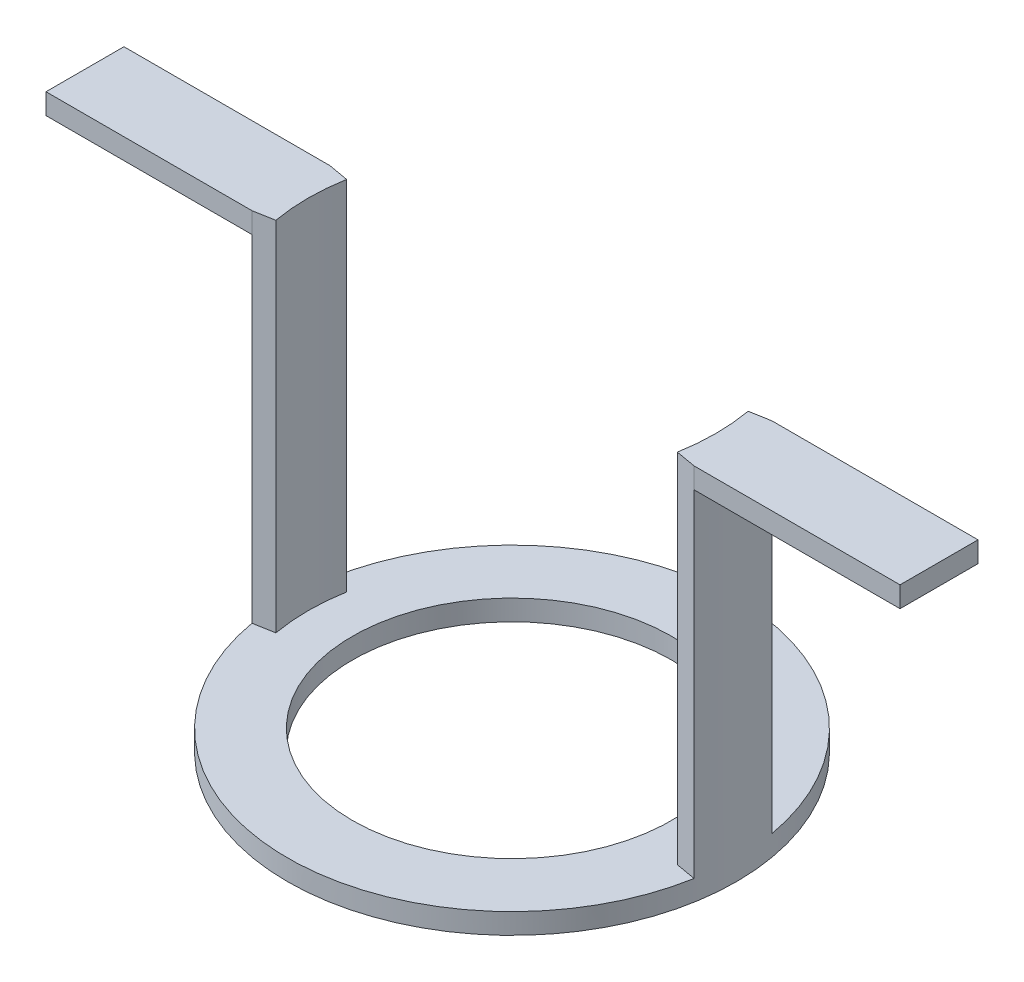
ISO-10303-21;
HEADER;
FILE_DESCRIPTION(('STEP AP214'),'2;1');
FILE_NAME('part.step','',(''),(''),'','','');
FILE_SCHEMA(('AUTOMOTIVE_DESIGN { 1 0 10303 214 1 1 1 1 }'));
ENDSEC;
DATA;
#1=APPLICATION_CONTEXT('core data for automotive mechanical design processes');
#2=APPLICATION_PROTOCOL_DEFINITION('international standard','automotive_design',2000,#1);
#3=PRODUCT_CONTEXT('',#1,'mechanical');
#4=PRODUCT('Part','Part','',(#3));
#5=PRODUCT_RELATED_PRODUCT_CATEGORY('part','',(#4));
#6=PRODUCT_DEFINITION_FORMATION('','',#4);
#7=PRODUCT_DEFINITION_CONTEXT('part definition',#1,'design');
#8=PRODUCT_DEFINITION('design','',#6,#7);
#9=PRODUCT_DEFINITION_SHAPE('','',#8);
#10=(LENGTH_UNIT() NAMED_UNIT(*) SI_UNIT(.MILLI.,.METRE.));
#11=(NAMED_UNIT(*) PLANE_ANGLE_UNIT() SI_UNIT($,.RADIAN.));
#12=(NAMED_UNIT(*) SI_UNIT($,.STERADIAN.) SOLID_ANGLE_UNIT());
#13=UNCERTAINTY_MEASURE_WITH_UNIT(LENGTH_MEASURE(1.E-05),#10,'distance_accuracy_value','');
#14=(GEOMETRIC_REPRESENTATION_CONTEXT(3) GLOBAL_UNCERTAINTY_ASSIGNED_CONTEXT((#13)) GLOBAL_UNIT_ASSIGNED_CONTEXT((#10,
#11,#12)) REPRESENTATION_CONTEXT('',''));
#15=CARTESIAN_POINT('',(0.,0.,0.));
#16=DIRECTION('',(0.,0.,1.));
#17=DIRECTION('',(1.,0.,0.));
#18=AXIS2_PLACEMENT_3D('',#15,#16,#17);
#19=CARTESIAN_POINT('',(0.,2.,0.));
#20=DIRECTION('',(0.,-1.,0.));
#21=DIRECTION('',(0.,0.,-1.));
#22=AXIS2_PLACEMENT_3D('',#19,#20,#21);
#23=CYLINDRICAL_SURFACE('',#22,21.8);
#24=CARTESIAN_POINT('',(0.,0.,0.));
#25=DIRECTION('',(0.,1.,0.));
#26=DIRECTION('',(0.,0.,1.));
#27=AXIS2_PLACEMENT_3D('',#24,#25,#26);
#28=CIRCLE('',#27,21.8);
#29=CARTESIAN_POINT('',(0.,0.,21.8));
#30=VERTEX_POINT('',#29);
#31=EDGE_CURVE('E250',#30,#30,#28,.T.);
#32=ORIENTED_EDGE('',*,*,#31,.T.);
#33=EDGE_LOOP('',(#32));
#34=FACE_BOUND('',#33,.T.);
#35=CARTESIAN_POINT('',(0.,34.6889226928998,0.));
#36=DIRECTION('',(0.,1.,0.));
#37=DIRECTION('',(0.,0.,1.));
#38=AXIS2_PLACEMENT_3D('',#35,#36,#37);
#39=CIRCLE('',#38,21.8);
#40=CARTESIAN_POINT('',(-21.4688090156661,34.6889226928998,3.78553027313909));
#41=VERTEX_POINT('',#40);
#42=CARTESIAN_POINT('',(-21.4688090156661,34.6889226928998,-3.78553027313907));
#43=VERTEX_POINT('',#42);
#44=EDGE_CURVE('E171',#41,#43,#39,.F.);
#45=ORIENTED_EDGE('',*,*,#44,.T.);
#46=DIRECTION('',(0.,-1.,0.));
#47=VECTOR('',#46,1.);
#48=CARTESIAN_POINT('',(-21.4688090156661,36.7,-3.78553027313907));
#49=LINE('',#48,#47);
#50=CARTESIAN_POINT('',(-21.4688090156661,2.,-3.78553027313909));
#51=VERTEX_POINT('',#50);
#52=EDGE_CURVE('E243',#43,#51,#49,.T.);
#53=ORIENTED_EDGE('',*,*,#52,.T.);
#54=CARTESIAN_POINT('',(0.,2.,0.));
#55=DIRECTION('',(0.,1.,0.));
#56=DIRECTION('',(0.,0.,1.));
#57=AXIS2_PLACEMENT_3D('',#54,#55,#56);
#58=CIRCLE('',#57,21.8);
#59=CARTESIAN_POINT('',(21.4688090156661,2.,-3.78553027313909));
#60=VERTEX_POINT('',#59);
#61=EDGE_CURVE('E41',#60,#51,#58,.T.);
#62=ORIENTED_EDGE('',*,*,#61,.F.);
#63=DIRECTION('',(0.,-1.,0.));
#64=VECTOR('',#63,1.);
#65=CARTESIAN_POINT('',(21.4688090156661,36.7,-3.78553027313909));
#66=LINE('',#65,#64);
#67=CARTESIAN_POINT('',(21.4688090156661,34.6889226928998,-3.78553027313909));
#68=VERTEX_POINT('',#67);
#69=EDGE_CURVE('E217',#68,#60,#66,.T.);
#70=ORIENTED_EDGE('',*,*,#69,.F.);
#71=CARTESIAN_POINT('',(0.,34.6889226928998,0.));
#72=DIRECTION('',(0.,-1.,0.));
#73=DIRECTION('',(0.,0.,-1.));
#74=AXIS2_PLACEMENT_3D('',#71,#72,#73);
#75=CIRCLE('',#74,21.8);
#76=CARTESIAN_POINT('',(21.4688090156661,34.6889226928998,3.78553027313909));
#77=VERTEX_POINT('',#76);
#78=EDGE_CURVE('E191',#77,#68,#75,.F.);
#79=ORIENTED_EDGE('',*,*,#78,.F.);
#80=DIRECTION('',(0.,-1.,0.));
#81=VECTOR('',#80,1.);
#82=CARTESIAN_POINT('',(21.4688090156661,36.7,3.78553027313909));
#83=LINE('',#82,#81);
#84=CARTESIAN_POINT('',(21.4688090156661,2.,3.78553027313909));
#85=VERTEX_POINT('',#84);
#86=EDGE_CURVE('E205',#77,#85,#83,.T.);
#87=ORIENTED_EDGE('',*,*,#86,.T.);
#88=CARTESIAN_POINT('',(-21.4688090156661,2.,3.78553027313909));
#89=VERTEX_POINT('',#88);
#90=EDGE_CURVE('E11',#89,#85,#58,.T.);
#91=ORIENTED_EDGE('',*,*,#90,.F.);
#92=DIRECTION('',(0.,-1.,0.));
#93=VECTOR('',#92,1.);
#94=CARTESIAN_POINT('',(-21.4688090156661,36.7,3.78553027313909));
#95=LINE('',#94,#93);
#96=EDGE_CURVE('E239',#41,#89,#95,.T.);
#97=ORIENTED_EDGE('',*,*,#96,.F.);
#98=EDGE_LOOP('',(#45,#53,#62,#70,#79,#87,#91,#97));
#99=FACE_BOUND('',#98,.T.);
#100=ADVANCED_FACE('F33',(#34,#99),#23,.T.);
#101=CARTESIAN_POINT('',(0.,2.,0.));
#102=DIRECTION('',(0.,1.,0.));
#103=DIRECTION('',(0.,0.,1.));
#104=AXIS2_PLACEMENT_3D('',#101,#102,#103);
#105=PLANE('',#104);
#106=CARTESIAN_POINT('',(0.,2.,0.));
#107=DIRECTION('',(0.,1.,0.));
#108=DIRECTION('',(0.,0.,1.));
#109=AXIS2_PLACEMENT_3D('',#106,#107,#108);
#110=CIRCLE('',#109,15.5);
#111=CARTESIAN_POINT('',(0.,2.,15.5));
#112=VERTEX_POINT('',#111);
#113=EDGE_CURVE('E248',#112,#112,#110,.T.);
#114=ORIENTED_EDGE('',*,*,#113,.F.);
#115=EDGE_LOOP('',(#114));
#116=FACE_BOUND('',#115,.T.);
#117=CARTESIAN_POINT('',(0.,2.,0.));
#118=DIRECTION('',(0.,-1.,0.));
#119=DIRECTION('',(0.,0.,-1.));
#120=AXIS2_PLACEMENT_3D('',#117,#118,#119);
#121=CIRCLE('',#120,19.7998050254632);
#122=CARTESIAN_POINT('',(19.4990014972063,2.,-3.43820006083222));
#123=VERTEX_POINT('',#122);
#124=CARTESIAN_POINT('',(19.4990014972063,2.,3.43820006083222));
#125=VERTEX_POINT('',#124);
#126=EDGE_CURVE('E207',#123,#125,#121,.T.);
#127=ORIENTED_EDGE('',*,*,#126,.F.);
#128=DIRECTION('',(-0.984807753012208,0.,0.173648177666931));
#129=VECTOR('',#128,1.);
#130=CARTESIAN_POINT('',(21.4688090156661,2.,-3.78553027313909));
#131=LINE('',#130,#129);
#132=EDGE_CURVE('E188',#60,#123,#131,.T.);
#133=ORIENTED_EDGE('',*,*,#132,.F.);
#134=ORIENTED_EDGE('',*,*,#61,.T.);
#135=DIRECTION('',(-0.984807753012208,0.,-0.173648177666931));
#136=VECTOR('',#135,1.);
#137=CARTESIAN_POINT('',(-19.4991669611093,2.,-3.43822923658267));
#138=LINE('',#137,#136);
#139=CARTESIAN_POINT('',(-19.4991669611093,2.,-3.43822923658267));
#140=VERTEX_POINT('',#139);
#141=EDGE_CURVE('E57',#140,#51,#138,.T.);
#142=ORIENTED_EDGE('',*,*,#141,.F.);
#143=CARTESIAN_POINT('',(0.,2.,0.));
#144=DIRECTION('',(0.,-1.,0.));
#145=DIRECTION('',(0.,0.,1.));
#146=AXIS2_PLACEMENT_3D('',#143,#144,#145);
#147=CIRCLE('',#146,19.7999730419137);
#148=CARTESIAN_POINT('',(-19.4991669611093,2.,3.43822923658265));
#149=VERTEX_POINT('',#148);
#150=EDGE_CURVE('E225',#149,#140,#147,.T.);
#151=ORIENTED_EDGE('',*,*,#150,.F.);
#152=DIRECTION('',(0.984807753012208,0.,-0.173648177666931));
#153=VECTOR('',#152,1.);
#154=CARTESIAN_POINT('',(-19.4991669611093,2.,3.43822923658267));
#155=LINE('',#154,#153);
#156=EDGE_CURVE('E233',#89,#149,#155,.T.);
#157=ORIENTED_EDGE('',*,*,#156,.F.);
#158=ORIENTED_EDGE('',*,*,#90,.T.);
#159=DIRECTION('',(0.984807753012208,0.,0.173648177666931));
#160=VECTOR('',#159,1.);
#161=CARTESIAN_POINT('',(21.4688090156661,2.,3.78553027313909));
#162=LINE('',#161,#160);
#163=EDGE_CURVE('E200',#125,#85,#162,.T.);
#164=ORIENTED_EDGE('',*,*,#163,.F.);
#165=EDGE_LOOP('',(#127,#133,#134,#142,#151,#157,#158,#164));
#166=FACE_BOUND('',#165,.T.);
#167=ADVANCED_FACE('F273',(#116,#166),#105,.T.);
#168=CARTESIAN_POINT('',(0.,0.,0.));
#169=DIRECTION('',(0.,1.,0.));
#170=DIRECTION('',(0.,0.,1.));
#171=AXIS2_PLACEMENT_3D('',#168,#169,#170);
#172=PLANE('',#171);
#173=CARTESIAN_POINT('',(0.,0.,0.));
#174=DIRECTION('',(0.,1.,0.));
#175=DIRECTION('',(0.,0.,1.));
#176=AXIS2_PLACEMENT_3D('',#173,#174,#175);
#177=CIRCLE('',#176,15.5);
#178=CARTESIAN_POINT('',(0.,0.,15.5));
#179=VERTEX_POINT('',#178);
#180=EDGE_CURVE('E36',#179,#179,#177,.T.);
#181=ORIENTED_EDGE('',*,*,#180,.T.);
#182=EDGE_LOOP('',(#181));
#183=FACE_BOUND('',#182,.T.);
#184=ORIENTED_EDGE('',*,*,#31,.F.);
#185=EDGE_LOOP('',(#184));
#186=FACE_BOUND('',#185,.T.);
#187=ADVANCED_FACE('F257',(#183,#186),#172,.F.);
#188=CARTESIAN_POINT('',(0.,-14.,0.));
#189=DIRECTION('',(0.,1.,0.));
#190=DIRECTION('',(0.,0.,1.));
#191=AXIS2_PLACEMENT_3D('',#188,#189,#190);
#192=CYLINDRICAL_SURFACE('',#191,15.5);
#193=ORIENTED_EDGE('',*,*,#113,.T.);
#194=EDGE_LOOP('',(#193));
#195=FACE_BOUND('',#194,.T.);
#196=ORIENTED_EDGE('',*,*,#180,.F.);
#197=EDGE_LOOP('',(#196));
#198=FACE_BOUND('',#197,.T.);
#199=ADVANCED_FACE('F260',(#195,#198),#192,.F.);
#200=CARTESIAN_POINT('',(-19.4991669611093,36.7,-3.43822923658267));
#201=DIRECTION('',(-0.173648177666931,0.,0.984807753012208));
#202=DIRECTION('',(0.984807753012208,0.,0.173648177666931));
#203=AXIS2_PLACEMENT_3D('',#200,#201,#202);
#204=PLANE('',#203);
#205=ORIENTED_EDGE('',*,*,#141,.T.);
#206=ORIENTED_EDGE('',*,*,#52,.F.);
#207=CARTESIAN_POINT('',(-21.4688090156661,36.7,-3.78553027313907));
#208=VERTEX_POINT('',#207);
#209=EDGE_CURVE('E144',#208,#43,#49,.T.);
#210=ORIENTED_EDGE('',*,*,#209,.F.);
#211=DIRECTION('',(-0.984807753012208,0.,-0.173648177666931));
#212=VECTOR('',#211,1.);
#213=CARTESIAN_POINT('',(-19.4991669611093,36.7,-3.43822923658267));
#214=LINE('',#213,#212);
#215=CARTESIAN_POINT('',(-19.4991669611093,36.7,-3.43822923658267));
#216=VERTEX_POINT('',#215);
#217=EDGE_CURVE('E224',#216,#208,#214,.T.);
#218=ORIENTED_EDGE('',*,*,#217,.F.);
#219=DIRECTION('',(0.,-1.,0.));
#220=VECTOR('',#219,1.);
#221=CARTESIAN_POINT('',(-19.4991669611093,36.7,-3.43822923658267));
#222=LINE('',#221,#220);
#223=EDGE_CURVE('E245',#216,#140,#222,.T.);
#224=ORIENTED_EDGE('',*,*,#223,.T.);
#225=EDGE_LOOP('',(#205,#206,#210,#218,#224));
#226=FACE_BOUND('',#225,.T.);
#227=ADVANCED_FACE('F262',(#226),#204,.F.);
#228=CARTESIAN_POINT('',(-19.4991669611093,36.7,3.43822923658267));
#229=DIRECTION('',(-0.173648177666931,0.,-0.984807753012208));
#230=DIRECTION('',(-0.984807753012208,0.,0.173648177666931));
#231=AXIS2_PLACEMENT_3D('',#228,#229,#230);
#232=PLANE('',#231);
#233=ORIENTED_EDGE('',*,*,#156,.T.);
#234=DIRECTION('',(0.,-1.,0.));
#235=VECTOR('',#234,1.);
#236=CARTESIAN_POINT('',(-19.4991669611093,36.7,3.43822923658265));
#237=LINE('',#236,#235);
#238=CARTESIAN_POINT('',(-19.4991669611093,36.7,3.43822923658265));
#239=VERTEX_POINT('',#238);
#240=EDGE_CURVE('E231',#239,#149,#237,.T.);
#241=ORIENTED_EDGE('',*,*,#240,.F.);
#242=DIRECTION('',(0.984807753012208,0.,-0.173648177666931));
#243=VECTOR('',#242,1.);
#244=CARTESIAN_POINT('',(-19.4991669611093,36.7,3.43822923658267));
#245=LINE('',#244,#243);
#246=CARTESIAN_POINT('',(-21.4688090156661,36.7,3.78553027313909));
#247=VERTEX_POINT('',#246);
#248=EDGE_CURVE('E228',#247,#239,#245,.T.);
#249=ORIENTED_EDGE('',*,*,#248,.F.);
#250=EDGE_CURVE('E240',#247,#41,#95,.T.);
#251=ORIENTED_EDGE('',*,*,#250,.T.);
#252=ORIENTED_EDGE('',*,*,#96,.T.);
#253=EDGE_LOOP('',(#233,#241,#249,#251,#252));
#254=FACE_BOUND('',#253,.T.);
#255=ADVANCED_FACE('F270',(#254),#232,.F.);
#256=CARTESIAN_POINT('',(0.,36.7,0.));
#257=DIRECTION('',(0.,-1.,0.));
#258=DIRECTION('',(0.,0.,-1.));
#259=AXIS2_PLACEMENT_3D('',#256,#257,#258);
#260=CYLINDRICAL_SURFACE('',#259,19.7999730419137);
#261=ORIENTED_EDGE('',*,*,#150,.T.);
#262=ORIENTED_EDGE('',*,*,#223,.F.);
#263=CARTESIAN_POINT('',(0.,36.7,0.));
#264=DIRECTION('',(0.,-1.,0.));
#265=DIRECTION('',(0.,0.,-1.));
#266=AXIS2_PLACEMENT_3D('',#263,#264,#265);
#267=CIRCLE('',#266,19.7999730419137);
#268=EDGE_CURVE('E221',#239,#216,#267,.T.);
#269=ORIENTED_EDGE('',*,*,#268,.F.);
#270=ORIENTED_EDGE('',*,*,#240,.T.);
#271=EDGE_LOOP('',(#261,#262,#269,#270));
#272=FACE_BOUND('',#271,.T.);
#273=ADVANCED_FACE('F287',(#272),#260,.F.);
#274=CARTESIAN_POINT('',(0.,36.7,0.));
#275=DIRECTION('',(0.,-1.,0.));
#276=DIRECTION('',(0.,0.,-1.));
#277=AXIS2_PLACEMENT_3D('',#274,#275,#276);
#278=PLANE('',#277);
#279=ORIENTED_EDGE('',*,*,#268,.T.);
#280=ORIENTED_EDGE('',*,*,#217,.T.);
#281=DIRECTION('',(-1.,0.,0.));
#282=VECTOR('',#281,1.);
#283=CARTESIAN_POINT('',(41.471,36.7,-3.78553027313907));
#284=LINE('',#283,#282);
#285=CARTESIAN_POINT('',(-41.47,36.7,-3.78553027313907));
#286=VERTEX_POINT('',#285);
#287=EDGE_CURVE('E169',#208,#286,#284,.T.);
#288=ORIENTED_EDGE('',*,*,#287,.T.);
#289=DIRECTION('',(0.,0.,-1.));
#290=VECTOR('',#289,1.);
#291=CARTESIAN_POINT('',(-41.47,36.7,-3.78553027313907));
#292=LINE('',#291,#290);
#293=CARTESIAN_POINT('',(-41.47,36.7,3.78553027313909));
#294=VERTEX_POINT('',#293);
#295=EDGE_CURVE('E149',#294,#286,#292,.T.);
#296=ORIENTED_EDGE('',*,*,#295,.F.);
#297=DIRECTION('',(-1.,0.,0.));
#298=VECTOR('',#297,1.);
#299=CARTESIAN_POINT('',(41.471,36.7,3.78553027313909));
#300=LINE('',#299,#298);
#301=EDGE_CURVE('E167',#247,#294,#300,.T.);
#302=ORIENTED_EDGE('',*,*,#301,.F.);
#303=ORIENTED_EDGE('',*,*,#248,.T.);
#304=EDGE_LOOP('',(#279,#280,#288,#296,#302,#303));
#305=FACE_BOUND('',#304,.T.);
#306=ADVANCED_FACE('F297',(#305),#278,.F.);
#307=CARTESIAN_POINT('',(21.4688090156661,36.7,-3.78553027313909));
#308=DIRECTION('',(0.173648177666931,0.,0.984807753012208));
#309=DIRECTION('',(0.984807753012208,0.,-0.173648177666931));
#310=AXIS2_PLACEMENT_3D('',#307,#308,#309);
#311=PLANE('',#310);
#312=ORIENTED_EDGE('',*,*,#132,.T.);
#313=DIRECTION('',(0.,-1.,0.));
#314=VECTOR('',#313,1.);
#315=CARTESIAN_POINT('',(19.4990014972063,36.7,-3.43820006083222));
#316=LINE('',#315,#314);
#317=CARTESIAN_POINT('',(19.4990014972063,36.7,-3.43820006083222));
#318=VERTEX_POINT('',#317);
#319=EDGE_CURVE('E214',#318,#123,#316,.T.);
#320=ORIENTED_EDGE('',*,*,#319,.F.);
#321=DIRECTION('',(-0.984807753012208,0.,0.173648177666931));
#322=VECTOR('',#321,1.);
#323=CARTESIAN_POINT('',(21.4688090156661,36.7,-3.78553027313909));
#324=LINE('',#323,#322);
#325=CARTESIAN_POINT('',(21.4688090156661,36.7,-3.78553027313909));
#326=VERTEX_POINT('',#325);
#327=EDGE_CURVE('E197',#326,#318,#324,.T.);
#328=ORIENTED_EDGE('',*,*,#327,.F.);
#329=EDGE_CURVE('E218',#326,#68,#66,.T.);
#330=ORIENTED_EDGE('',*,*,#329,.T.);
#331=ORIENTED_EDGE('',*,*,#69,.T.);
#332=EDGE_LOOP('',(#312,#320,#328,#330,#331));
#333=FACE_BOUND('',#332,.T.);
#334=ADVANCED_FACE('F299',(#333),#311,.F.);
#335=CARTESIAN_POINT('',(0.,36.7,0.));
#336=DIRECTION('',(0.,-1.,0.));
#337=DIRECTION('',(0.,0.,-1.));
#338=AXIS2_PLACEMENT_3D('',#335,#336,#337);
#339=CYLINDRICAL_SURFACE('',#338,19.7998050254632);
#340=ORIENTED_EDGE('',*,*,#126,.T.);
#341=DIRECTION('',(0.,-1.,0.));
#342=VECTOR('',#341,1.);
#343=CARTESIAN_POINT('',(19.4990014972063,36.7,3.43820006083222));
#344=LINE('',#343,#342);
#345=CARTESIAN_POINT('',(19.4990014972063,36.7,3.43820006083222));
#346=VERTEX_POINT('',#345);
#347=EDGE_CURVE('E49',#346,#125,#344,.T.);
#348=ORIENTED_EDGE('',*,*,#347,.F.);
#349=CARTESIAN_POINT('',(0.,36.7,0.));
#350=DIRECTION('',(0.,-1.,0.));
#351=DIRECTION('',(0.,0.,1.));
#352=AXIS2_PLACEMENT_3D('',#349,#350,#351);
#353=CIRCLE('',#352,19.7998050254632);
#354=EDGE_CURVE('E199',#318,#346,#353,.T.);
#355=ORIENTED_EDGE('',*,*,#354,.F.);
#356=ORIENTED_EDGE('',*,*,#319,.T.);
#357=EDGE_LOOP('',(#340,#348,#355,#356));
#358=FACE_BOUND('',#357,.T.);
#359=ADVANCED_FACE('F305',(#358),#339,.F.);
#360=CARTESIAN_POINT('',(21.4688090156661,36.7,3.78553027313909));
#361=DIRECTION('',(0.173648177666931,0.,-0.984807753012208));
#362=DIRECTION('',(-0.984807753012208,0.,-0.173648177666931));
#363=AXIS2_PLACEMENT_3D('',#360,#361,#362);
#364=PLANE('',#363);
#365=ORIENTED_EDGE('',*,*,#163,.T.);
#366=ORIENTED_EDGE('',*,*,#86,.F.);
#367=CARTESIAN_POINT('',(21.4688090156661,36.7,3.78553027313909));
#368=VERTEX_POINT('',#367);
#369=EDGE_CURVE('E210',#368,#77,#83,.T.);
#370=ORIENTED_EDGE('',*,*,#369,.F.);
#371=DIRECTION('',(0.984807753012208,0.,0.173648177666931));
#372=VECTOR('',#371,1.);
#373=CARTESIAN_POINT('',(21.4688090156661,36.7,3.78553027313909));
#374=LINE('',#373,#372);
#375=EDGE_CURVE('E202',#346,#368,#374,.T.);
#376=ORIENTED_EDGE('',*,*,#375,.F.);
#377=ORIENTED_EDGE('',*,*,#347,.T.);
#378=EDGE_LOOP('',(#365,#366,#370,#376,#377));
#379=FACE_BOUND('',#378,.T.);
#380=ADVANCED_FACE('F333',(#379),#364,.F.);
#381=CARTESIAN_POINT('',(0.,36.7,0.));
#382=DIRECTION('',(0.,-1.,0.));
#383=DIRECTION('',(0.,0.,-1.));
#384=AXIS2_PLACEMENT_3D('',#381,#382,#383);
#385=PLANE('',#384);
#386=ORIENTED_EDGE('',*,*,#375,.T.);
#387=DIRECTION('',(1.,0.,0.));
#388=VECTOR('',#387,1.);
#389=CARTESIAN_POINT('',(-21.801,36.7,3.78553027313909));
#390=LINE('',#389,#388);
#391=CARTESIAN_POINT('',(41.47,36.7,3.78553027313909));
#392=VERTEX_POINT('',#391);
#393=EDGE_CURVE('E185',#368,#392,#390,.T.);
#394=ORIENTED_EDGE('',*,*,#393,.T.);
#395=DIRECTION('',(0.,0.,1.));
#396=VECTOR('',#395,1.);
#397=CARTESIAN_POINT('',(41.47,36.7,-3.78553027313907));
#398=LINE('',#397,#396);
#399=CARTESIAN_POINT('',(41.47,36.7,-3.78553027313907));
#400=VERTEX_POINT('',#399);
#401=EDGE_CURVE('E176',#400,#392,#398,.T.);
#402=ORIENTED_EDGE('',*,*,#401,.F.);
#403=DIRECTION('',(1.,0.,0.));
#404=VECTOR('',#403,1.);
#405=CARTESIAN_POINT('',(-21.801,36.7,-3.78553027313907));
#406=LINE('',#405,#404);
#407=EDGE_CURVE('E186',#326,#400,#406,.T.);
#408=ORIENTED_EDGE('',*,*,#407,.F.);
#409=ORIENTED_EDGE('',*,*,#327,.T.);
#410=ORIENTED_EDGE('',*,*,#354,.T.);
#411=EDGE_LOOP('',(#386,#394,#402,#408,#409,#410));
#412=FACE_BOUND('',#411,.T.);
#413=ADVANCED_FACE('F349',(#412),#385,.F.);
#414=CARTESIAN_POINT('',(-21.801,36.7,3.78553027313909));
#415=DIRECTION('',(0.,0.,1.));
#416=DIRECTION('',(1.,0.,0.));
#417=AXIS2_PLACEMENT_3D('',#414,#415,#416);
#418=PLANE('',#417);
#419=ORIENTED_EDGE('',*,*,#393,.F.);
#420=ORIENTED_EDGE('',*,*,#369,.T.);
#421=DIRECTION('',(1.,0.,0.));
#422=VECTOR('',#421,1.);
#423=CARTESIAN_POINT('',(-21.801,34.6889226928998,3.78553027313909));
#424=LINE('',#423,#422);
#425=CARTESIAN_POINT('',(41.47,34.6889226928998,3.78553027313909));
#426=VERTEX_POINT('',#425);
#427=EDGE_CURVE('E194',#77,#426,#424,.T.);
#428=ORIENTED_EDGE('',*,*,#427,.T.);
#429=DIRECTION('',(0.,-1.,0.));
#430=VECTOR('',#429,1.);
#431=CARTESIAN_POINT('',(41.47,34.6889226928998,3.78553027313909));
#432=LINE('',#431,#430);
#433=EDGE_CURVE('E179',#392,#426,#432,.T.);
#434=ORIENTED_EDGE('',*,*,#433,.F.);
#435=EDGE_LOOP('',(#419,#420,#428,#434));
#436=FACE_BOUND('',#435,.T.);
#437=ADVANCED_FACE('F359',(#436),#418,.T.);
#438=CARTESIAN_POINT('',(-21.801,34.6889226928998,-3.78553027313907));
#439=DIRECTION('',(0.,-1.,0.));
#440=DIRECTION('',(0.,0.,-1.));
#441=AXIS2_PLACEMENT_3D('',#438,#439,#440);
#442=PLANE('',#441);
#443=ORIENTED_EDGE('',*,*,#427,.F.);
#444=ORIENTED_EDGE('',*,*,#78,.T.);
#445=DIRECTION('',(1.,0.,0.));
#446=VECTOR('',#445,1.);
#447=CARTESIAN_POINT('',(-21.801,34.6889226928998,-3.78553027313907));
#448=LINE('',#447,#446);
#449=CARTESIAN_POINT('',(41.47,34.6889226928998,-3.78553027313907));
#450=VERTEX_POINT('',#449);
#451=EDGE_CURVE('E189',#68,#450,#448,.T.);
#452=ORIENTED_EDGE('',*,*,#451,.T.);
#453=DIRECTION('',(0.,0.,-1.));
#454=VECTOR('',#453,1.);
#455=CARTESIAN_POINT('',(41.47,34.6889226928998,-3.78553027313907));
#456=LINE('',#455,#454);
#457=EDGE_CURVE('E182',#426,#450,#456,.T.);
#458=ORIENTED_EDGE('',*,*,#457,.F.);
#459=EDGE_LOOP('',(#443,#444,#452,#458));
#460=FACE_BOUND('',#459,.T.);
#461=ADVANCED_FACE('F371',(#460),#442,.T.);
#462=CARTESIAN_POINT('',(-21.801,36.7,-3.78553027313907));
#463=DIRECTION('',(0.,0.,-1.));
#464=DIRECTION('',(-1.,0.,0.));
#465=AXIS2_PLACEMENT_3D('',#462,#463,#464);
#466=PLANE('',#465);
#467=ORIENTED_EDGE('',*,*,#451,.F.);
#468=ORIENTED_EDGE('',*,*,#329,.F.);
#469=ORIENTED_EDGE('',*,*,#407,.T.);
#470=DIRECTION('',(0.,1.,0.));
#471=VECTOR('',#470,1.);
#472=CARTESIAN_POINT('',(41.47,34.6889226928998,-3.78553027313907));
#473=LINE('',#472,#471);
#474=EDGE_CURVE('E173',#450,#400,#473,.T.);
#475=ORIENTED_EDGE('',*,*,#474,.F.);
#476=EDGE_LOOP('',(#467,#468,#469,#475));
#477=FACE_BOUND('',#476,.T.);
#478=ADVANCED_FACE('F382',(#477),#466,.T.);
#479=CARTESIAN_POINT('',(41.47,0.,0.));
#480=DIRECTION('',(1.,0.,0.));
#481=DIRECTION('',(0.,0.,-1.));
#482=AXIS2_PLACEMENT_3D('',#479,#480,#481);
#483=PLANE('',#482);
#484=ORIENTED_EDGE('',*,*,#474,.T.);
#485=ORIENTED_EDGE('',*,*,#401,.T.);
#486=ORIENTED_EDGE('',*,*,#433,.T.);
#487=ORIENTED_EDGE('',*,*,#457,.T.);
#488=EDGE_LOOP('',(#484,#485,#486,#487));
#489=FACE_BOUND('',#488,.T.);
#490=ADVANCED_FACE('F393',(#489),#483,.T.);
#491=CARTESIAN_POINT('',(41.471,34.6889226928998,-3.78553027313907));
#492=DIRECTION('',(0.,1.,0.));
#493=DIRECTION('',(0.,0.,1.));
#494=AXIS2_PLACEMENT_3D('',#491,#492,#493);
#495=PLANE('',#494);
#496=ORIENTED_EDGE('',*,*,#44,.F.);
#497=DIRECTION('',(-1.,0.,0.));
#498=VECTOR('',#497,1.);
#499=CARTESIAN_POINT('',(41.471,34.6889226928998,3.78553027313909));
#500=LINE('',#499,#498);
#501=CARTESIAN_POINT('',(-41.47,34.6889226928998,3.78553027313909));
#502=VERTEX_POINT('',#501);
#503=EDGE_CURVE('E148',#41,#502,#500,.T.);
#504=ORIENTED_EDGE('',*,*,#503,.T.);
#505=DIRECTION('',(0.,0.,1.));
#506=VECTOR('',#505,1.);
#507=CARTESIAN_POINT('',(-41.47,34.6889226928998,-3.78553027313907));
#508=LINE('',#507,#506);
#509=CARTESIAN_POINT('',(-41.47,34.6889226928998,-3.78553027313907));
#510=VERTEX_POINT('',#509);
#511=EDGE_CURVE('E152',#510,#502,#508,.T.);
#512=ORIENTED_EDGE('',*,*,#511,.F.);
#513=DIRECTION('',(-1.,0.,0.));
#514=VECTOR('',#513,1.);
#515=CARTESIAN_POINT('',(41.471,34.6889226928998,-3.78553027313907));
#516=LINE('',#515,#514);
#517=EDGE_CURVE('E138',#43,#510,#516,.T.);
#518=ORIENTED_EDGE('',*,*,#517,.F.);
#519=EDGE_LOOP('',(#496,#504,#512,#518));
#520=FACE_BOUND('',#519,.T.);
#521=ADVANCED_FACE('F153',(#520),#495,.F.);
#522=CARTESIAN_POINT('',(41.471,36.7,3.78553027313909));
#523=DIRECTION('',(0.,0.,-1.));
#524=DIRECTION('',(-1.,0.,0.));
#525=AXIS2_PLACEMENT_3D('',#522,#523,#524);
#526=PLANE('',#525);
#527=ORIENTED_EDGE('',*,*,#250,.F.);
#528=ORIENTED_EDGE('',*,*,#301,.T.);
#529=DIRECTION('',(0.,1.,0.));
#530=VECTOR('',#529,1.);
#531=CARTESIAN_POINT('',(-41.47,36.7,3.78553027313909));
#532=LINE('',#531,#530);
#533=EDGE_CURVE('E157',#502,#294,#532,.T.);
#534=ORIENTED_EDGE('',*,*,#533,.F.);
#535=ORIENTED_EDGE('',*,*,#503,.F.);
#536=EDGE_LOOP('',(#527,#528,#534,#535));
#537=FACE_BOUND('',#536,.T.);
#538=ADVANCED_FACE('F295',(#537),#526,.F.);
#539=CARTESIAN_POINT('',(41.471,36.7,-3.78553027313907));
#540=DIRECTION('',(0.,0.,1.));
#541=DIRECTION('',(1.,0.,0.));
#542=AXIS2_PLACEMENT_3D('',#539,#540,#541);
#543=PLANE('',#542);
#544=ORIENTED_EDGE('',*,*,#209,.T.);
#545=ORIENTED_EDGE('',*,*,#517,.T.);
#546=DIRECTION('',(0.,-1.,0.));
#547=VECTOR('',#546,1.);
#548=CARTESIAN_POINT('',(-41.47,36.7,-3.78553027313907));
#549=LINE('',#548,#547);
#550=EDGE_CURVE('E142',#286,#510,#549,.T.);
#551=ORIENTED_EDGE('',*,*,#550,.F.);
#552=ORIENTED_EDGE('',*,*,#287,.F.);
#553=EDGE_LOOP('',(#544,#545,#551,#552));
#554=FACE_BOUND('',#553,.T.);
#555=ADVANCED_FACE('F140',(#554),#543,.F.);
#556=CARTESIAN_POINT('',(-41.47,0.,0.));
#557=DIRECTION('',(-1.,0.,0.));
#558=DIRECTION('',(0.,0.,1.));
#559=AXIS2_PLACEMENT_3D('',#556,#557,#558);
#560=PLANE('',#559);
#561=ORIENTED_EDGE('',*,*,#550,.T.);
#562=ORIENTED_EDGE('',*,*,#511,.T.);
#563=ORIENTED_EDGE('',*,*,#533,.T.);
#564=ORIENTED_EDGE('',*,*,#295,.T.);
#565=EDGE_LOOP('',(#561,#562,#563,#564));
#566=FACE_BOUND('',#565,.T.);
#567=ADVANCED_FACE('F160',(#566),#560,.T.);
#568=CLOSED_SHELL('',(#100,#167,#187,#199,#227,#255,#273,#306,#334,#359,#380,#413,#437,#461,
#478,#490,#521,#538,#555,#567));
#569=MANIFOLD_SOLID_BREP('B2',#568);
#570=ADVANCED_BREP_SHAPE_REPRESENTATION('',(#18,#569),#14);
#571=SHAPE_DEFINITION_REPRESENTATION(#9,#570);
ENDSEC;
END-ISO-10303-21;
